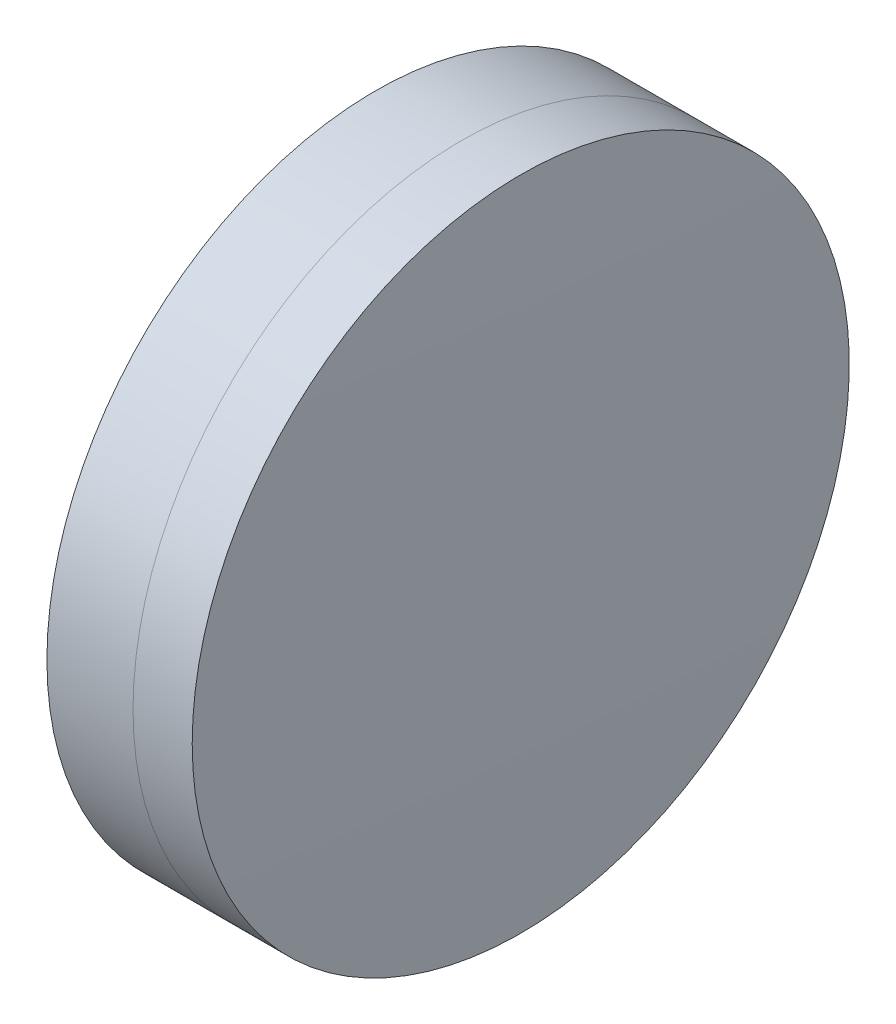
ISO-10303-21;
HEADER;
FILE_DESCRIPTION(('STEP AP214'),'2;1');
FILE_NAME('part.step','',(''),(''),'','','');
FILE_SCHEMA(('AUTOMOTIVE_DESIGN { 1 0 10303 214 1 1 1 1 }'));
ENDSEC;
DATA;
#1=APPLICATION_CONTEXT('core data for automotive mechanical design processes');
#2=APPLICATION_PROTOCOL_DEFINITION('international standard','automotive_design',2000,#1);
#3=PRODUCT_CONTEXT('',#1,'mechanical');
#4=PRODUCT('Part','Part','',(#3));
#5=PRODUCT_RELATED_PRODUCT_CATEGORY('part','',(#4));
#6=PRODUCT_DEFINITION_FORMATION('','',#4);
#7=PRODUCT_DEFINITION_CONTEXT('part definition',#1,'design');
#8=PRODUCT_DEFINITION('design','',#6,#7);
#9=PRODUCT_DEFINITION_SHAPE('','',#8);
#10=(LENGTH_UNIT() NAMED_UNIT(*) SI_UNIT(.MILLI.,.METRE.));
#11=(NAMED_UNIT(*) PLANE_ANGLE_UNIT() SI_UNIT($,.RADIAN.));
#12=(NAMED_UNIT(*) SI_UNIT($,.STERADIAN.) SOLID_ANGLE_UNIT());
#13=UNCERTAINTY_MEASURE_WITH_UNIT(LENGTH_MEASURE(1.E-05),#10,'distance_accuracy_value','');
#14=(GEOMETRIC_REPRESENTATION_CONTEXT(3) GLOBAL_UNCERTAINTY_ASSIGNED_CONTEXT((#13)) GLOBAL_UNIT_ASSIGNED_CONTEXT((#10,
#11,#12)) REPRESENTATION_CONTEXT('',''));
#15=CARTESIAN_POINT('',(0.,0.,0.));
#16=DIRECTION('',(0.,0.,1.));
#17=DIRECTION('',(1.,0.,0.));
#18=AXIS2_PLACEMENT_3D('',#15,#16,#17);
#19=CARTESIAN_POINT('',(180.899447543102,0.,0.));
#20=DIRECTION('',(-1.,0.,0.));
#21=DIRECTION('',(0.,0.,1.));
#22=AXIS2_PLACEMENT_3D('',#19,#20,#21);
#23=SPHERICAL_SURFACE('',#22,186.800000000002);
#24=CARTESIAN_POINT('',(367.267229093457,0.,0.));
#25=DIRECTION('',(-1.,0.,0.));
#26=DIRECTION('',(0.,0.,1.));
#27=AXIS2_PLACEMENT_3D('',#24,#25,#26);
#28=CIRCLE('',#27,12.7000000000001);
#29=CARTESIAN_POINT('',(367.267229093457,0.,12.7000000000001));
#30=VERTEX_POINT('',#29);
#31=EDGE_CURVE('E11',#30,#30,#28,.T.);
#32=ORIENTED_EDGE('',*,*,#31,.T.);
#33=EDGE_LOOP('',(#32));
#34=FACE_BOUND('',#33,.T.);
#35=ADVANCED_FACE('F45',(#34),#23,.F.);
#36=CARTESIAN_POINT('',(-0.551919992657797,0.,0.));
#37=DIRECTION('',(-1.,0.,0.));
#38=DIRECTION('',(0.,0.,1.));
#39=AXIS2_PLACEMENT_3D('',#36,#37,#38);
#40=CYLINDRICAL_SURFACE('',#39,12.7);
#41=CARTESIAN_POINT('',(369.554748101116,0.,0.));
#42=DIRECTION('',(-1.,0.,0.));
#43=DIRECTION('',(0.,0.,1.));
#44=AXIS2_PLACEMENT_3D('',#41,#42,#43);
#45=CIRCLE('',#44,12.7);
#46=CARTESIAN_POINT('',(369.554748101116,0.,12.7));
#47=VERTEX_POINT('',#46);
#48=EDGE_CURVE('E51',#47,#47,#45,.T.);
#49=ORIENTED_EDGE('',*,*,#48,.T.);
#50=EDGE_LOOP('',(#49));
#51=FACE_BOUND('',#50,.T.);
#52=ORIENTED_EDGE('',*,*,#31,.F.);
#53=EDGE_LOOP('',(#52));
#54=FACE_BOUND('',#53,.T.);
#55=ADVANCED_FACE('F57',(#51,#54),#40,.T.);
#56=CARTESIAN_POINT('',(-187.700552456896,0.,0.));
#57=DIRECTION('',(-1.,0.,0.));
#58=DIRECTION('',(0.,0.,1.));
#59=AXIS2_PLACEMENT_3D('',#56,#57,#58);
#60=SPHERICAL_SURFACE('',#59,557.4);
#61=ORIENTED_EDGE('',*,*,#48,.F.);
#62=EDGE_LOOP('',(#61));
#63=FACE_BOUND('',#62,.T.);
#64=ADVANCED_FACE('F60',(#63),#60,.T.);
#65=CLOSED_SHELL('',(#35,#55,#64));
#66=MANIFOLD_SOLID_BREP('B2',#65);
#67=CARTESIAN_POINT('',(700.999447543102,0.,0.));
#68=DIRECTION('',(-1.,0.,0.));
#69=DIRECTION('',(0.,0.,1.));
#70=AXIS2_PLACEMENT_3D('',#67,#68,#69);
#71=SPHERICAL_SURFACE('',#70,337.3);
#72=CARTESIAN_POINT('',(363.938622171776,0.,0.));
#73=DIRECTION('',(-1.,0.,0.));
#74=DIRECTION('',(0.,0.,1.));
#75=AXIS2_PLACEMENT_3D('',#72,#73,#74);
#76=CIRCLE('',#75,12.7);
#77=CARTESIAN_POINT('',(363.938622171776,0.,12.7));
#78=VERTEX_POINT('',#77);
#79=EDGE_CURVE('E44',#78,#78,#76,.T.);
#80=ORIENTED_EDGE('',*,*,#79,.T.);
#81=EDGE_LOOP('',(#80));
#82=FACE_BOUND('',#81,.T.);
#83=ADVANCED_FACE('F86',(#82),#71,.T.);
#84=CARTESIAN_POINT('',(235.807450690754,0.,0.));
#85=DIRECTION('',(-1.,0.,0.));
#86=DIRECTION('',(0.,0.,1.));
#87=AXIS2_PLACEMENT_3D('',#84,#85,#86);
#88=CYLINDRICAL_SURFACE('',#87,12.7);
#89=CARTESIAN_POINT('',(367.267229093457,0.,0.));
#90=DIRECTION('',(-1.,0.,0.));
#91=DIRECTION('',(0.,0.,1.));
#92=AXIS2_PLACEMENT_3D('',#89,#90,#91);
#93=CIRCLE('',#92,12.7);
#94=CARTESIAN_POINT('',(367.267229093457,0.,12.7));
#95=VERTEX_POINT('',#94);
#96=EDGE_CURVE('E92',#95,#95,#93,.T.);
#97=ORIENTED_EDGE('',*,*,#96,.T.);
#98=EDGE_LOOP('',(#97));
#99=FACE_BOUND('',#98,.T.);
#100=ORIENTED_EDGE('',*,*,#79,.F.);
#101=EDGE_LOOP('',(#100));
#102=FACE_BOUND('',#101,.T.);
#103=ADVANCED_FACE('F98',(#99,#102),#88,.T.);
#104=CARTESIAN_POINT('',(180.899447543102,0.,0.));
#105=DIRECTION('',(-1.,0.,0.));
#106=DIRECTION('',(0.,0.,1.));
#107=AXIS2_PLACEMENT_3D('',#104,#105,#106);
#108=SPHERICAL_SURFACE('',#107,186.800000000002);
#109=ORIENTED_EDGE('',*,*,#96,.F.);
#110=EDGE_LOOP('',(#109));
#111=FACE_BOUND('',#110,.T.);
#112=ADVANCED_FACE('F101',(#111),#108,.T.);
#113=CLOSED_SHELL('',(#83,#103,#112));
#114=MANIFOLD_SOLID_BREP('B6',#113);
#115=ADVANCED_BREP_SHAPE_REPRESENTATION('',(#18,#66,#114),#14);
#116=SHAPE_DEFINITION_REPRESENTATION(#9,#115);
ENDSEC;
END-ISO-10303-21;
